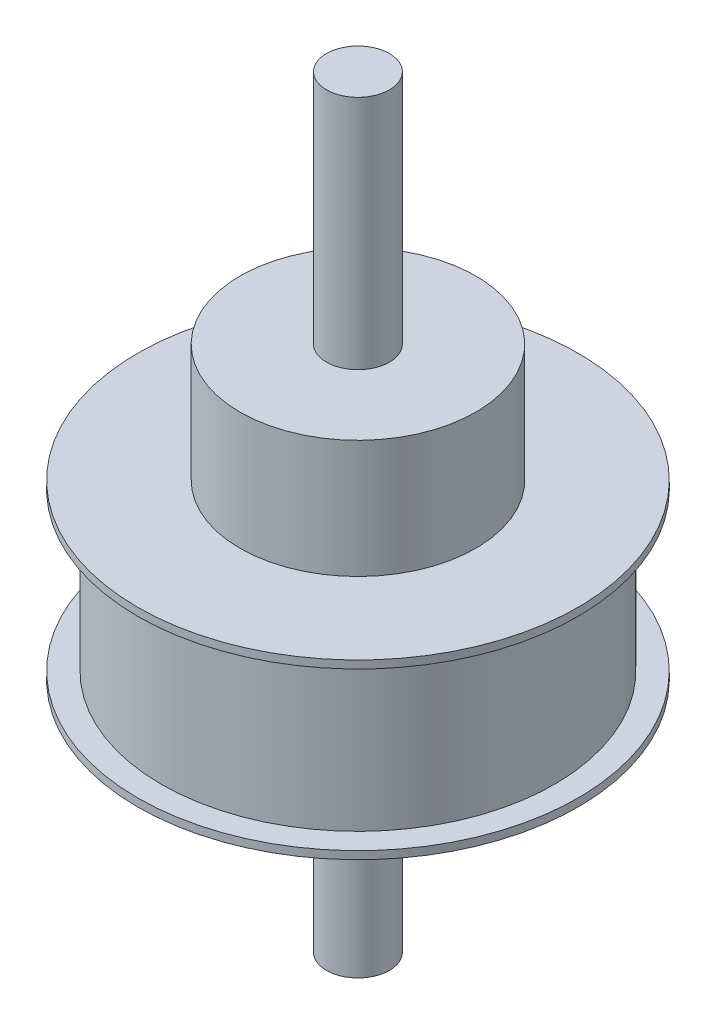
ISO-10303-21;
HEADER;
FILE_DESCRIPTION(('STEP AP214'),'2;1');
FILE_NAME('part.step','',(''),(''),'','','');
FILE_SCHEMA(('AUTOMOTIVE_DESIGN { 1 0 10303 214 1 1 1 1 }'));
ENDSEC;
DATA;
#1=APPLICATION_CONTEXT('core data for automotive mechanical design processes');
#2=APPLICATION_PROTOCOL_DEFINITION('international standard','automotive_design',2000,#1);
#3=PRODUCT_CONTEXT('',#1,'mechanical');
#4=PRODUCT('Part','Part','',(#3));
#5=PRODUCT_RELATED_PRODUCT_CATEGORY('part','',(#4));
#6=PRODUCT_DEFINITION_FORMATION('','',#4);
#7=PRODUCT_DEFINITION_CONTEXT('part definition',#1,'design');
#8=PRODUCT_DEFINITION('design','',#6,#7);
#9=PRODUCT_DEFINITION_SHAPE('','',#8);
#10=(LENGTH_UNIT() NAMED_UNIT(*) SI_UNIT(.MILLI.,.METRE.));
#11=(NAMED_UNIT(*) PLANE_ANGLE_UNIT() SI_UNIT($,.RADIAN.));
#12=(NAMED_UNIT(*) SI_UNIT($,.STERADIAN.) SOLID_ANGLE_UNIT());
#13=UNCERTAINTY_MEASURE_WITH_UNIT(LENGTH_MEASURE(1.E-05),#10,'distance_accuracy_value','');
#14=(GEOMETRIC_REPRESENTATION_CONTEXT(3) GLOBAL_UNCERTAINTY_ASSIGNED_CONTEXT((#13)) GLOBAL_UNIT_ASSIGNED_CONTEXT((#10,
#11,#12)) REPRESENTATION_CONTEXT('',''));
#15=CARTESIAN_POINT('',(0.,0.,0.));
#16=DIRECTION('',(0.,0.,1.));
#17=DIRECTION('',(1.,0.,0.));
#18=AXIS2_PLACEMENT_3D('',#15,#16,#17);
#19=CARTESIAN_POINT('',(0.,37.,0.));
#20=DIRECTION('',(0.,1.,0.));
#21=DIRECTION('',(0.,0.,1.));
#22=AXIS2_PLACEMENT_3D('',#19,#20,#21);
#23=PLANE('',#22);
#24=CARTESIAN_POINT('',(0.,37.,0.));
#25=DIRECTION('',(0.,1.,0.));
#26=DIRECTION('',(0.,0.,1.));
#27=AXIS2_PLACEMENT_3D('',#24,#25,#26);
#28=CIRCLE('',#27,15.);
#29=CARTESIAN_POINT('',(0.,37.,15.));
#30=VERTEX_POINT('',#29);
#31=EDGE_CURVE('E53',#30,#30,#28,.T.);
#32=ORIENTED_EDGE('',*,*,#31,.T.);
#33=EDGE_LOOP('',(#32));
#34=FACE_BOUND('',#33,.T.);
#35=CARTESIAN_POINT('',(0.,37.,0.));
#36=DIRECTION('',(0.,1.,0.));
#37=DIRECTION('',(0.,0.,1.));
#38=AXIS2_PLACEMENT_3D('',#35,#36,#37);
#39=CIRCLE('',#38,4.);
#40=CARTESIAN_POINT('',(0.,37.,4.));
#41=VERTEX_POINT('',#40);
#42=EDGE_CURVE('E62',#41,#41,#39,.T.);
#43=ORIENTED_EDGE('',*,*,#42,.F.);
#44=EDGE_LOOP('',(#43));
#45=FACE_BOUND('',#44,.T.);
#46=ADVANCED_FACE('F31',(#34,#45),#23,.T.);
#47=CARTESIAN_POINT('',(0.,22.,0.));
#48=DIRECTION('',(0.,1.,0.));
#49=DIRECTION('',(0.,0.,1.));
#50=AXIS2_PLACEMENT_3D('',#47,#48,#49);
#51=PLANE('',#50);
#52=CARTESIAN_POINT('',(0.,22.,0.));
#53=DIRECTION('',(0.,1.,0.));
#54=DIRECTION('',(0.,0.,1.));
#55=AXIS2_PLACEMENT_3D('',#52,#53,#54);
#56=CIRCLE('',#55,28.);
#57=CARTESIAN_POINT('',(0.,22.,28.));
#58=VERTEX_POINT('',#57);
#59=EDGE_CURVE('E47',#58,#58,#56,.T.);
#60=ORIENTED_EDGE('',*,*,#59,.T.);
#61=EDGE_LOOP('',(#60));
#62=FACE_BOUND('',#61,.T.);
#63=CARTESIAN_POINT('',(0.,22.,0.));
#64=DIRECTION('',(0.,1.,0.));
#65=DIRECTION('',(0.,0.,1.));
#66=AXIS2_PLACEMENT_3D('',#63,#64,#65);
#67=CIRCLE('',#66,15.);
#68=CARTESIAN_POINT('',(0.,22.,15.));
#69=VERTEX_POINT('',#68);
#70=EDGE_CURVE('E56',#69,#69,#67,.T.);
#71=ORIENTED_EDGE('',*,*,#70,.F.);
#72=EDGE_LOOP('',(#71));
#73=FACE_BOUND('',#72,.T.);
#74=ADVANCED_FACE('F86',(#62,#73),#51,.T.);
#75=CARTESIAN_POINT('',(0.,21.,0.));
#76=DIRECTION('',(0.,-1.,0.));
#77=DIRECTION('',(0.,0.,-1.));
#78=AXIS2_PLACEMENT_3D('',#75,#76,#77);
#79=CYLINDRICAL_SURFACE('',#78,25.);
#80=CARTESIAN_POINT('',(0.,1.,0.));
#81=DIRECTION('',(0.,1.,0.));
#82=DIRECTION('',(0.,0.,1.));
#83=AXIS2_PLACEMENT_3D('',#80,#81,#82);
#84=CIRCLE('',#83,25.);
#85=CARTESIAN_POINT('',(0.,1.,25.));
#86=VERTEX_POINT('',#85);
#87=EDGE_CURVE('E35',#86,#86,#84,.T.);
#88=ORIENTED_EDGE('',*,*,#87,.T.);
#89=EDGE_LOOP('',(#88));
#90=FACE_BOUND('',#89,.T.);
#91=CARTESIAN_POINT('',(0.,21.,0.));
#92=DIRECTION('',(0.,1.,0.));
#93=DIRECTION('',(0.,0.,1.));
#94=AXIS2_PLACEMENT_3D('',#91,#92,#93);
#95=CIRCLE('',#94,25.);
#96=CARTESIAN_POINT('',(0.,21.,25.));
#97=VERTEX_POINT('',#96);
#98=EDGE_CURVE('E10',#97,#97,#95,.T.);
#99=ORIENTED_EDGE('',*,*,#98,.F.);
#100=EDGE_LOOP('',(#99));
#101=FACE_BOUND('',#100,.T.);
#102=ADVANCED_FACE('F33',(#90,#101),#79,.T.);
#103=CARTESIAN_POINT('',(0.,1.,0.));
#104=DIRECTION('',(0.,1.,0.));
#105=DIRECTION('',(0.,0.,1.));
#106=AXIS2_PLACEMENT_3D('',#103,#104,#105);
#107=PLANE('',#106);
#108=CARTESIAN_POINT('',(0.,1.,0.));
#109=DIRECTION('',(0.,1.,0.));
#110=DIRECTION('',(0.,0.,1.));
#111=AXIS2_PLACEMENT_3D('',#108,#109,#110);
#112=CIRCLE('',#111,28.);
#113=CARTESIAN_POINT('',(0.,1.,28.));
#114=VERTEX_POINT('',#113);
#115=EDGE_CURVE('E42',#114,#114,#112,.T.);
#116=ORIENTED_EDGE('',*,*,#115,.T.);
#117=EDGE_LOOP('',(#116));
#118=FACE_BOUND('',#117,.T.);
#119=ORIENTED_EDGE('',*,*,#87,.F.);
#120=EDGE_LOOP('',(#119));
#121=FACE_BOUND('',#120,.T.);
#122=ADVANCED_FACE('F112',(#118,#121),#107,.T.);
#123=CARTESIAN_POINT('',(0.,1.,0.));
#124=DIRECTION('',(0.,-1.,0.));
#125=DIRECTION('',(0.,0.,-1.));
#126=AXIS2_PLACEMENT_3D('',#123,#124,#125);
#127=CYLINDRICAL_SURFACE('',#126,28.);
#128=ORIENTED_EDGE('',*,*,#115,.F.);
#129=EDGE_LOOP('',(#128));
#130=FACE_BOUND('',#129,.T.);
#131=CARTESIAN_POINT('',(0.,0.,0.));
#132=DIRECTION('',(0.,1.,0.));
#133=DIRECTION('',(0.,0.,1.));
#134=AXIS2_PLACEMENT_3D('',#131,#132,#133);
#135=CIRCLE('',#134,28.);
#136=CARTESIAN_POINT('',(0.,0.,28.));
#137=VERTEX_POINT('',#136);
#138=EDGE_CURVE('E44',#137,#137,#135,.T.);
#139=ORIENTED_EDGE('',*,*,#138,.T.);
#140=EDGE_LOOP('',(#139));
#141=FACE_BOUND('',#140,.T.);
#142=ADVANCED_FACE('F115',(#130,#141),#127,.T.);
#143=CARTESIAN_POINT('',(0.,0.,0.));
#144=DIRECTION('',(0.,1.,0.));
#145=DIRECTION('',(0.,0.,1.));
#146=AXIS2_PLACEMENT_3D('',#143,#144,#145);
#147=PLANE('',#146);
#148=CARTESIAN_POINT('',(0.,0.,0.));
#149=DIRECTION('',(0.,1.,0.));
#150=DIRECTION('',(0.,0.,1.));
#151=AXIS2_PLACEMENT_3D('',#148,#149,#150);
#152=CIRCLE('',#151,4.);
#153=CARTESIAN_POINT('',(0.,0.,4.));
#154=VERTEX_POINT('',#153);
#155=EDGE_CURVE('E68',#154,#154,#152,.T.);
#156=ORIENTED_EDGE('',*,*,#155,.T.);
#157=EDGE_LOOP('',(#156));
#158=FACE_BOUND('',#157,.T.);
#159=ORIENTED_EDGE('',*,*,#138,.F.);
#160=EDGE_LOOP('',(#159));
#161=FACE_BOUND('',#160,.T.);
#162=ADVANCED_FACE('F107',(#158,#161),#147,.F.);
#163=CARTESIAN_POINT('',(0.,21.,0.));
#164=DIRECTION('',(0.,1.,0.));
#165=DIRECTION('',(0.,0.,1.));
#166=AXIS2_PLACEMENT_3D('',#163,#164,#165);
#167=PLANE('',#166);
#168=CARTESIAN_POINT('',(0.,21.,0.));
#169=DIRECTION('',(0.,1.,0.));
#170=DIRECTION('',(0.,0.,1.));
#171=AXIS2_PLACEMENT_3D('',#168,#169,#170);
#172=CIRCLE('',#171,28.);
#173=CARTESIAN_POINT('',(0.,21.,28.));
#174=VERTEX_POINT('',#173);
#175=EDGE_CURVE('E50',#174,#174,#172,.T.);
#176=ORIENTED_EDGE('',*,*,#175,.F.);
#177=EDGE_LOOP('',(#176));
#178=FACE_BOUND('',#177,.T.);
#179=ORIENTED_EDGE('',*,*,#98,.T.);
#180=EDGE_LOOP('',(#179));
#181=FACE_BOUND('',#180,.T.);
#182=ADVANCED_FACE('F104',(#178,#181),#167,.F.);
#183=CARTESIAN_POINT('',(0.,22.,0.));
#184=DIRECTION('',(0.,-1.,0.));
#185=DIRECTION('',(0.,0.,-1.));
#186=AXIS2_PLACEMENT_3D('',#183,#184,#185);
#187=CYLINDRICAL_SURFACE('',#186,28.);
#188=ORIENTED_EDGE('',*,*,#59,.F.);
#189=EDGE_LOOP('',(#188));
#190=FACE_BOUND('',#189,.T.);
#191=ORIENTED_EDGE('',*,*,#175,.T.);
#192=EDGE_LOOP('',(#191));
#193=FACE_BOUND('',#192,.T.);
#194=ADVANCED_FACE('F101',(#190,#193),#187,.T.);
#195=CARTESIAN_POINT('',(0.,37.,0.));
#196=DIRECTION('',(0.,-1.,0.));
#197=DIRECTION('',(0.,0.,-1.));
#198=AXIS2_PLACEMENT_3D('',#195,#196,#197);
#199=CYLINDRICAL_SURFACE('',#198,15.);
#200=ORIENTED_EDGE('',*,*,#31,.F.);
#201=EDGE_LOOP('',(#200));
#202=FACE_BOUND('',#201,.T.);
#203=ORIENTED_EDGE('',*,*,#70,.T.);
#204=EDGE_LOOP('',(#203));
#205=FACE_BOUND('',#204,.T.);
#206=ADVANCED_FACE('F99',(#202,#205),#199,.T.);
#207=CARTESIAN_POINT('',(0.,67.,0.));
#208=DIRECTION('',(0.,-1.,0.));
#209=DIRECTION('',(0.,0.,-1.));
#210=AXIS2_PLACEMENT_3D('',#207,#208,#209);
#211=CYLINDRICAL_SURFACE('',#210,4.);
#212=CARTESIAN_POINT('',(0.,67.,0.));
#213=DIRECTION('',(0.,1.,0.));
#214=DIRECTION('',(0.,0.,1.));
#215=AXIS2_PLACEMENT_3D('',#212,#213,#214);
#216=CIRCLE('',#215,4.);
#217=CARTESIAN_POINT('',(0.,67.,4.));
#218=VERTEX_POINT('',#217);
#219=EDGE_CURVE('E59',#218,#218,#216,.T.);
#220=ORIENTED_EDGE('',*,*,#219,.F.);
#221=EDGE_LOOP('',(#220));
#222=FACE_BOUND('',#221,.T.);
#223=ORIENTED_EDGE('',*,*,#42,.T.);
#224=EDGE_LOOP('',(#223));
#225=FACE_BOUND('',#224,.T.);
#226=ADVANCED_FACE('F97',(#222,#225),#211,.T.);
#227=CARTESIAN_POINT('',(0.,67.,0.));
#228=DIRECTION('',(0.,1.,0.));
#229=DIRECTION('',(0.,0.,1.));
#230=AXIS2_PLACEMENT_3D('',#227,#228,#229);
#231=PLANE('',#230);
#232=ORIENTED_EDGE('',*,*,#219,.T.);
#233=EDGE_LOOP('',(#232));
#234=FACE_BOUND('',#233,.T.);
#235=ADVANCED_FACE('F83',(#234),#231,.T.);
#236=CARTESIAN_POINT('',(0.,-30.,0.));
#237=DIRECTION('',(0.,1.,0.));
#238=DIRECTION('',(0.,0.,1.));
#239=AXIS2_PLACEMENT_3D('',#236,#237,#238);
#240=CYLINDRICAL_SURFACE('',#239,4.);
#241=CARTESIAN_POINT('',(0.,-30.,0.));
#242=DIRECTION('',(0.,1.,0.));
#243=DIRECTION('',(0.,0.,1.));
#244=AXIS2_PLACEMENT_3D('',#241,#242,#243);
#245=CIRCLE('',#244,4.);
#246=CARTESIAN_POINT('',(0.,-30.,4.));
#247=VERTEX_POINT('',#246);
#248=EDGE_CURVE('E65',#247,#247,#245,.T.);
#249=ORIENTED_EDGE('',*,*,#248,.T.);
#250=EDGE_LOOP('',(#249));
#251=FACE_BOUND('',#250,.T.);
#252=ORIENTED_EDGE('',*,*,#155,.F.);
#253=EDGE_LOOP('',(#252));
#254=FACE_BOUND('',#253,.T.);
#255=ADVANCED_FACE('F74',(#251,#254),#240,.T.);
#256=CARTESIAN_POINT('',(0.,-30.,0.));
#257=DIRECTION('',(0.,1.,0.));
#258=DIRECTION('',(0.,0.,1.));
#259=AXIS2_PLACEMENT_3D('',#256,#257,#258);
#260=PLANE('',#259);
#261=ORIENTED_EDGE('',*,*,#248,.F.);
#262=EDGE_LOOP('',(#261));
#263=FACE_BOUND('',#262,.T.);
#264=ADVANCED_FACE('F77',(#263),#260,.F.);
#265=CLOSED_SHELL('',(#46,#74,#102,#122,#142,#162,#182,#194,#206,#226,#235,#255,#264));
#266=MANIFOLD_SOLID_BREP('B2',#265);
#267=ADVANCED_BREP_SHAPE_REPRESENTATION('',(#18,#266),#14);
#268=SHAPE_DEFINITION_REPRESENTATION(#9,#267);
ENDSEC;
END-ISO-10303-21;
